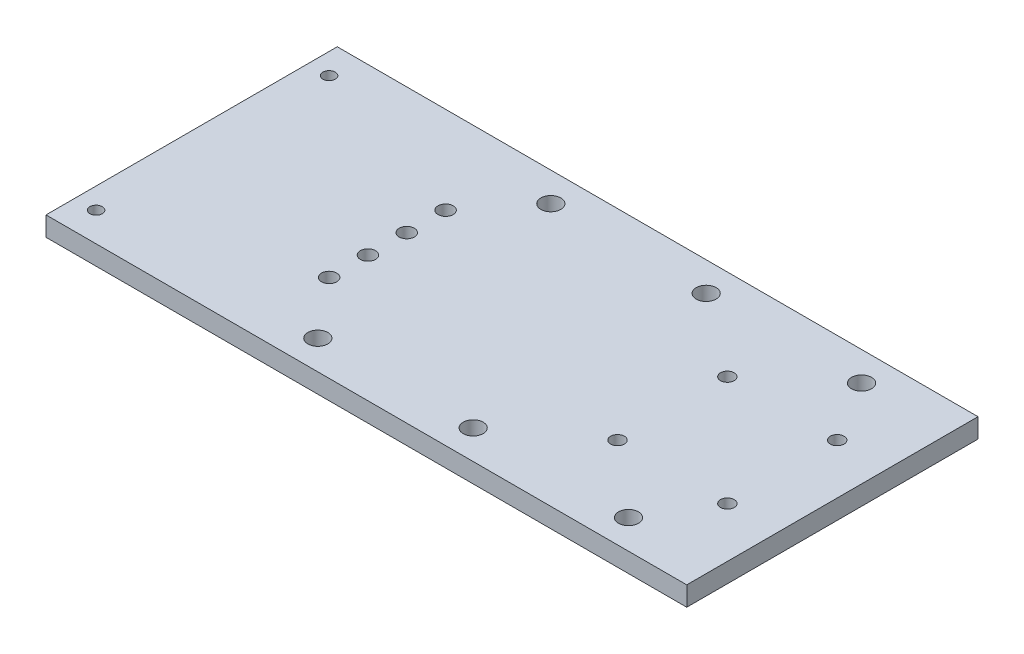
ISO-10303-21;
HEADER;
FILE_DESCRIPTION(('STEP AP214'),'2;1');
FILE_NAME('part.step','',(''),(''),'','','');
FILE_SCHEMA(('AUTOMOTIVE_DESIGN { 1 0 10303 214 1 1 1 1 }'));
ENDSEC;
DATA;
#1=APPLICATION_CONTEXT('core data for automotive mechanical design processes');
#2=APPLICATION_PROTOCOL_DEFINITION('international standard','automotive_design',2000,#1);
#3=PRODUCT_CONTEXT('',#1,'mechanical');
#4=PRODUCT('Part','Part','',(#3));
#5=PRODUCT_RELATED_PRODUCT_CATEGORY('part','',(#4));
#6=PRODUCT_DEFINITION_FORMATION('','',#4);
#7=PRODUCT_DEFINITION_CONTEXT('part definition',#1,'design');
#8=PRODUCT_DEFINITION('design','',#6,#7);
#9=PRODUCT_DEFINITION_SHAPE('','',#8);
#10=(LENGTH_UNIT() NAMED_UNIT(*) SI_UNIT(.MILLI.,.METRE.));
#11=(NAMED_UNIT(*) PLANE_ANGLE_UNIT() SI_UNIT($,.RADIAN.));
#12=(NAMED_UNIT(*) SI_UNIT($,.STERADIAN.) SOLID_ANGLE_UNIT());
#13=UNCERTAINTY_MEASURE_WITH_UNIT(LENGTH_MEASURE(1.E-05),#10,'distance_accuracy_value','');
#14=(GEOMETRIC_REPRESENTATION_CONTEXT(3) GLOBAL_UNCERTAINTY_ASSIGNED_CONTEXT((#13)) GLOBAL_UNIT_ASSIGNED_CONTEXT((#10,
#11,#12)) REPRESENTATION_CONTEXT('',''));
#15=CARTESIAN_POINT('',(0.,0.,0.));
#16=DIRECTION('',(0.,0.,1.));
#17=DIRECTION('',(1.,0.,0.));
#18=AXIS2_PLACEMENT_3D('',#15,#16,#17);
#19=CARTESIAN_POINT('',(104.775,6.35,47.625));
#20=DIRECTION('',(-1.,0.,0.));
#21=DIRECTION('',(0.,0.,1.));
#22=AXIS2_PLACEMENT_3D('',#19,#20,#21);
#23=PLANE('',#22);
#24=DIRECTION('',(0.,0.,-1.));
#25=VECTOR('',#24,1.);
#26=CARTESIAN_POINT('',(104.775,0.,47.625));
#27=LINE('',#26,#25);
#28=CARTESIAN_POINT('',(104.775,0.,47.625));
#29=VERTEX_POINT('',#28);
#30=CARTESIAN_POINT('',(104.775,0.,-47.625));
#31=VERTEX_POINT('',#30);
#32=EDGE_CURVE('E107',#29,#31,#27,.T.);
#33=ORIENTED_EDGE('',*,*,#32,.T.);
#34=DIRECTION('',(0.,-1.,0.));
#35=VECTOR('',#34,1.);
#36=CARTESIAN_POINT('',(104.775,6.35,-47.625));
#37=LINE('',#36,#35);
#38=CARTESIAN_POINT('',(104.775,6.35,-47.625));
#39=VERTEX_POINT('',#38);
#40=EDGE_CURVE('E11',#39,#31,#37,.T.);
#41=ORIENTED_EDGE('',*,*,#40,.F.);
#42=DIRECTION('',(0.,0.,-1.));
#43=VECTOR('',#42,1.);
#44=CARTESIAN_POINT('',(104.775,6.35,47.625));
#45=LINE('',#44,#43);
#46=CARTESIAN_POINT('',(104.775,6.35,47.625));
#47=VERTEX_POINT('',#46);
#48=EDGE_CURVE('E91',#47,#39,#45,.T.);
#49=ORIENTED_EDGE('',*,*,#48,.F.);
#50=DIRECTION('',(0.,-1.,0.));
#51=VECTOR('',#50,1.);
#52=CARTESIAN_POINT('',(104.775,6.35,47.625));
#53=LINE('',#52,#51);
#54=EDGE_CURVE('E103',#47,#29,#53,.T.);
#55=ORIENTED_EDGE('',*,*,#54,.T.);
#56=EDGE_LOOP('',(#33,#41,#49,#55));
#57=FACE_BOUND('',#56,.T.);
#58=ADVANCED_FACE('F39',(#57),#23,.F.);
#59=CARTESIAN_POINT('',(-104.775,6.35,-47.625));
#60=DIRECTION('',(0.,0.,1.));
#61=DIRECTION('',(1.,0.,0.));
#62=AXIS2_PLACEMENT_3D('',#59,#60,#61);
#63=PLANE('',#62);
#64=DIRECTION('',(-1.,0.,0.));
#65=VECTOR('',#64,1.);
#66=CARTESIAN_POINT('',(-104.775,0.,-47.625));
#67=LINE('',#66,#65);
#68=CARTESIAN_POINT('',(-104.775,0.,-47.625));
#69=VERTEX_POINT('',#68);
#70=EDGE_CURVE('E96',#31,#69,#67,.T.);
#71=ORIENTED_EDGE('',*,*,#70,.T.);
#72=DIRECTION('',(0.,-1.,0.));
#73=VECTOR('',#72,1.);
#74=CARTESIAN_POINT('',(-104.775,6.35,-47.625));
#75=LINE('',#74,#73);
#76=CARTESIAN_POINT('',(-104.775,6.35,-47.625));
#77=VERTEX_POINT('',#76);
#78=EDGE_CURVE('E48',#77,#69,#75,.T.);
#79=ORIENTED_EDGE('',*,*,#78,.F.);
#80=DIRECTION('',(-1.,0.,0.));
#81=VECTOR('',#80,1.);
#82=CARTESIAN_POINT('',(-104.775,6.35,-47.625));
#83=LINE('',#82,#81);
#84=EDGE_CURVE('E86',#39,#77,#83,.T.);
#85=ORIENTED_EDGE('',*,*,#84,.F.);
#86=ORIENTED_EDGE('',*,*,#40,.T.);
#87=EDGE_LOOP('',(#71,#79,#85,#86));
#88=FACE_BOUND('',#87,.T.);
#89=ADVANCED_FACE('F95',(#88),#63,.F.);
#90=CARTESIAN_POINT('',(-104.775,6.35,47.625));
#91=DIRECTION('',(1.,0.,0.));
#92=DIRECTION('',(0.,0.,-1.));
#93=AXIS2_PLACEMENT_3D('',#90,#91,#92);
#94=PLANE('',#93);
#95=DIRECTION('',(0.,0.,1.));
#96=VECTOR('',#95,1.);
#97=CARTESIAN_POINT('',(-104.775,0.,47.625));
#98=LINE('',#97,#96);
#99=CARTESIAN_POINT('',(-104.775,0.,47.625));
#100=VERTEX_POINT('',#99);
#101=EDGE_CURVE('E73',#69,#100,#98,.T.);
#102=ORIENTED_EDGE('',*,*,#101,.T.);
#103=DIRECTION('',(0.,-1.,0.));
#104=VECTOR('',#103,1.);
#105=CARTESIAN_POINT('',(-104.775,6.35,47.625));
#106=LINE('',#105,#104);
#107=CARTESIAN_POINT('',(-104.775,6.35,47.625));
#108=VERTEX_POINT('',#107);
#109=EDGE_CURVE('E98',#108,#100,#106,.T.);
#110=ORIENTED_EDGE('',*,*,#109,.F.);
#111=DIRECTION('',(0.,0.,1.));
#112=VECTOR('',#111,1.);
#113=CARTESIAN_POINT('',(-104.775,6.35,47.625));
#114=LINE('',#113,#112);
#115=EDGE_CURVE('E89',#77,#108,#114,.T.);
#116=ORIENTED_EDGE('',*,*,#115,.F.);
#117=ORIENTED_EDGE('',*,*,#78,.T.);
#118=EDGE_LOOP('',(#102,#110,#116,#117));
#119=FACE_BOUND('',#118,.T.);
#120=ADVANCED_FACE('F99',(#119),#94,.F.);
#121=CARTESIAN_POINT('',(-104.775,6.35,47.625));
#122=DIRECTION('',(0.,0.,-1.));
#123=DIRECTION('',(-1.,0.,0.));
#124=AXIS2_PLACEMENT_3D('',#121,#122,#123);
#125=PLANE('',#124);
#126=DIRECTION('',(1.,0.,0.));
#127=VECTOR('',#126,1.);
#128=CARTESIAN_POINT('',(-104.775,0.,47.625));
#129=LINE('',#128,#127);
#130=EDGE_CURVE('E79',#100,#29,#129,.T.);
#131=ORIENTED_EDGE('',*,*,#130,.T.);
#132=ORIENTED_EDGE('',*,*,#54,.F.);
#133=DIRECTION('',(1.,0.,0.));
#134=VECTOR('',#133,1.);
#135=CARTESIAN_POINT('',(-104.775,6.35,47.625));
#136=LINE('',#135,#134);
#137=EDGE_CURVE('E56',#108,#47,#136,.T.);
#138=ORIENTED_EDGE('',*,*,#137,.F.);
#139=ORIENTED_EDGE('',*,*,#109,.T.);
#140=EDGE_LOOP('',(#131,#132,#138,#139));
#141=FACE_BOUND('',#140,.T.);
#142=ADVANCED_FACE('F121',(#141),#125,.F.);
#143=CARTESIAN_POINT('',(0.,6.35,0.));
#144=DIRECTION('',(0.,-1.,0.));
#145=DIRECTION('',(0.,0.,-1.));
#146=AXIS2_PLACEMENT_3D('',#143,#144,#145);
#147=PLANE('',#146);
#148=CARTESIAN_POINT('',(-25.4,6.35,38.1));
#149=DIRECTION('',(0.,-1.,0.));
#150=DIRECTION('',(0.,0.,-1.));
#151=AXIS2_PLACEMENT_3D('',#148,#149,#150);
#152=CIRCLE('',#151,3.2639);
#153=CARTESIAN_POINT('',(-25.4,6.35,34.8361));
#154=VERTEX_POINT('',#153);
#155=EDGE_CURVE('E248',#154,#154,#152,.T.);
#156=ORIENTED_EDGE('',*,*,#155,.T.);
#157=EDGE_LOOP('',(#156));
#158=FACE_BOUND('',#157,.T.);
#159=CARTESIAN_POINT('',(25.4,6.35,38.1));
#160=DIRECTION('',(0.,-1.,0.));
#161=DIRECTION('',(0.,0.,-1.));
#162=AXIS2_PLACEMENT_3D('',#159,#160,#161);
#163=CIRCLE('',#162,3.2639);
#164=CARTESIAN_POINT('',(25.4,6.35,34.8361));
#165=VERTEX_POINT('',#164);
#166=EDGE_CURVE('E240',#165,#165,#163,.T.);
#167=ORIENTED_EDGE('',*,*,#166,.T.);
#168=EDGE_LOOP('',(#167));
#169=FACE_BOUND('',#168,.T.);
#170=CARTESIAN_POINT('',(76.2,6.35,38.1));
#171=DIRECTION('',(0.,-1.,0.));
#172=DIRECTION('',(0.,0.,-1.));
#173=AXIS2_PLACEMENT_3D('',#170,#171,#172);
#174=CIRCLE('',#173,3.2639);
#175=CARTESIAN_POINT('',(76.2,6.35,34.8361));
#176=VERTEX_POINT('',#175);
#177=EDGE_CURVE('E232',#176,#176,#174,.T.);
#178=ORIENTED_EDGE('',*,*,#177,.T.);
#179=EDGE_LOOP('',(#178));
#180=FACE_BOUND('',#179,.T.);
#181=CARTESIAN_POINT('',(-25.4,6.35,-38.1));
#182=DIRECTION('',(0.,1.,0.));
#183=DIRECTION('',(0.,0.,1.));
#184=AXIS2_PLACEMENT_3D('',#181,#182,#183);
#185=CIRCLE('',#184,3.2639);
#186=CARTESIAN_POINT('',(-25.4,6.35,-34.8361));
#187=VERTEX_POINT('',#186);
#188=EDGE_CURVE('E225',#187,#187,#185,.T.);
#189=ORIENTED_EDGE('',*,*,#188,.F.);
#190=EDGE_LOOP('',(#189));
#191=FACE_BOUND('',#190,.T.);
#192=CARTESIAN_POINT('',(25.4,6.35,-38.1));
#193=DIRECTION('',(0.,1.,0.));
#194=DIRECTION('',(0.,0.,1.));
#195=AXIS2_PLACEMENT_3D('',#192,#193,#194);
#196=CIRCLE('',#195,3.2639);
#197=CARTESIAN_POINT('',(25.4,6.35,-34.8361));
#198=VERTEX_POINT('',#197);
#199=EDGE_CURVE('E217',#198,#198,#196,.T.);
#200=ORIENTED_EDGE('',*,*,#199,.F.);
#201=EDGE_LOOP('',(#200));
#202=FACE_BOUND('',#201,.T.);
#203=CARTESIAN_POINT('',(76.2,6.35,-38.1));
#204=DIRECTION('',(0.,1.,0.));
#205=DIRECTION('',(0.,0.,1.));
#206=AXIS2_PLACEMENT_3D('',#203,#204,#205);
#207=CIRCLE('',#206,3.2639);
#208=CARTESIAN_POINT('',(76.2,6.35,-34.8361));
#209=VERTEX_POINT('',#208);
#210=EDGE_CURVE('E208',#209,#209,#207,.T.);
#211=ORIENTED_EDGE('',*,*,#210,.F.);
#212=EDGE_LOOP('',(#211));
#213=FACE_BOUND('',#212,.T.);
#214=CARTESIAN_POINT('',(52.47132,6.35,17.96034));
#215=DIRECTION('',(0.,1.,0.));
#216=DIRECTION('',(0.,0.,1.));
#217=AXIS2_PLACEMENT_3D('',#214,#215,#216);
#218=CIRCLE('',#217,2.2479);
#219=CARTESIAN_POINT('',(52.47132,6.35,20.20824));
#220=VERTEX_POINT('',#219);
#221=EDGE_CURVE('E184',#220,#220,#218,.T.);
#222=ORIENTED_EDGE('',*,*,#221,.F.);
#223=EDGE_LOOP('',(#222));
#224=FACE_BOUND('',#223,.T.);
#225=CARTESIAN_POINT('',(88.392,6.35,17.96034));
#226=DIRECTION('',(0.,1.,0.));
#227=DIRECTION('',(0.,0.,1.));
#228=AXIS2_PLACEMENT_3D('',#225,#226,#227);
#229=CIRCLE('',#228,2.2479);
#230=CARTESIAN_POINT('',(88.392,6.35,20.20824));
#231=VERTEX_POINT('',#230);
#232=EDGE_CURVE('E193',#231,#231,#229,.T.);
#233=ORIENTED_EDGE('',*,*,#232,.F.);
#234=EDGE_LOOP('',(#233));
#235=FACE_BOUND('',#234,.T.);
#236=CARTESIAN_POINT('',(88.392,6.35,-17.96034));
#237=DIRECTION('',(0.,1.,0.));
#238=DIRECTION('',(0.,0.,1.));
#239=AXIS2_PLACEMENT_3D('',#236,#237,#238);
#240=CIRCLE('',#239,2.2479);
#241=CARTESIAN_POINT('',(88.392,6.35,-15.71244));
#242=VERTEX_POINT('',#241);
#243=EDGE_CURVE('E201',#242,#242,#240,.T.);
#244=ORIENTED_EDGE('',*,*,#243,.F.);
#245=EDGE_LOOP('',(#244));
#246=FACE_BOUND('',#245,.T.);
#247=CARTESIAN_POINT('',(52.47132,6.35,-17.96034));
#248=DIRECTION('',(0.,1.,0.));
#249=DIRECTION('',(0.,0.,1.));
#250=AXIS2_PLACEMENT_3D('',#247,#248,#249);
#251=CIRCLE('',#250,2.2479);
#252=CARTESIAN_POINT('',(52.47132,6.35,-15.71244));
#253=VERTEX_POINT('',#252);
#254=EDGE_CURVE('E176',#253,#253,#251,.T.);
#255=ORIENTED_EDGE('',*,*,#254,.F.);
#256=EDGE_LOOP('',(#255));
#257=FACE_BOUND('',#256,.T.);
#258=CARTESIAN_POINT('',(-40.767,6.35,-6.35));
#259=DIRECTION('',(0.,-1.,0.));
#260=DIRECTION('',(0.,0.,-1.));
#261=AXIS2_PLACEMENT_3D('',#258,#259,#260);
#262=CIRCLE('',#261,2.4892);
#263=CARTESIAN_POINT('',(-40.767,6.35,-8.83920000000001));
#264=VERTEX_POINT('',#263);
#265=EDGE_CURVE('E169',#264,#264,#262,.T.);
#266=ORIENTED_EDGE('',*,*,#265,.T.);
#267=EDGE_LOOP('',(#266));
#268=FACE_BOUND('',#267,.T.);
#269=CARTESIAN_POINT('',(-40.767,6.35,-19.05));
#270=DIRECTION('',(0.,-1.,0.));
#271=DIRECTION('',(0.,0.,-1.));
#272=AXIS2_PLACEMENT_3D('',#269,#270,#271);
#273=CIRCLE('',#272,2.4892);
#274=CARTESIAN_POINT('',(-40.767,6.35,-21.5392));
#275=VERTEX_POINT('',#274);
#276=EDGE_CURVE('E160',#275,#275,#273,.T.);
#277=ORIENTED_EDGE('',*,*,#276,.T.);
#278=EDGE_LOOP('',(#277));
#279=FACE_BOUND('',#278,.T.);
#280=CARTESIAN_POINT('',(-40.767,6.35,6.35));
#281=DIRECTION('',(0.,1.,0.));
#282=DIRECTION('',(0.,0.,1.));
#283=AXIS2_PLACEMENT_3D('',#280,#281,#282);
#284=CIRCLE('',#283,2.4892);
#285=CARTESIAN_POINT('',(-40.767,6.35,8.83920000000001));
#286=VERTEX_POINT('',#285);
#287=EDGE_CURVE('E153',#286,#286,#284,.T.);
#288=ORIENTED_EDGE('',*,*,#287,.F.);
#289=EDGE_LOOP('',(#288));
#290=FACE_BOUND('',#289,.T.);
#291=CARTESIAN_POINT('',(-40.767,6.35,19.05));
#292=DIRECTION('',(0.,1.,0.));
#293=DIRECTION('',(0.,0.,1.));
#294=AXIS2_PLACEMENT_3D('',#291,#292,#293);
#295=CIRCLE('',#294,2.4892);
#296=CARTESIAN_POINT('',(-40.767,6.35,21.5392));
#297=VERTEX_POINT('',#296);
#298=EDGE_CURVE('E144',#297,#297,#295,.T.);
#299=ORIENTED_EDGE('',*,*,#298,.F.);
#300=EDGE_LOOP('',(#299));
#301=FACE_BOUND('',#300,.T.);
#302=CARTESIAN_POINT('',(-97.917,6.35,-38.1));
#303=DIRECTION('',(0.,-1.,0.));
#304=DIRECTION('',(0.,0.,-1.));
#305=AXIS2_PLACEMENT_3D('',#302,#303,#304);
#306=CIRCLE('',#305,2.01930000000001);
#307=CARTESIAN_POINT('',(-97.917,6.35,-40.1193));
#308=VERTEX_POINT('',#307);
#309=EDGE_CURVE('E136',#308,#308,#306,.T.);
#310=ORIENTED_EDGE('',*,*,#309,.T.);
#311=EDGE_LOOP('',(#310));
#312=FACE_BOUND('',#311,.T.);
#313=CARTESIAN_POINT('',(-97.917,6.35,38.1));
#314=DIRECTION('',(0.,1.,0.));
#315=DIRECTION('',(0.,0.,1.));
#316=AXIS2_PLACEMENT_3D('',#313,#314,#315);
#317=CIRCLE('',#316,2.01930000000001);
#318=CARTESIAN_POINT('',(-97.917,6.35,40.1193));
#319=VERTEX_POINT('',#318);
#320=EDGE_CURVE('E128',#319,#319,#317,.T.);
#321=ORIENTED_EDGE('',*,*,#320,.F.);
#322=EDGE_LOOP('',(#321));
#323=FACE_BOUND('',#322,.T.);
#324=ORIENTED_EDGE('',*,*,#48,.T.);
#325=ORIENTED_EDGE('',*,*,#84,.T.);
#326=ORIENTED_EDGE('',*,*,#115,.T.);
#327=ORIENTED_EDGE('',*,*,#137,.T.);
#328=EDGE_LOOP('',(#324,#325,#326,#327));
#329=FACE_BOUND('',#328,.T.);
#330=ADVANCED_FACE('F87',(#158,#169,#180,#191,#202,#213,#224,#235,#246,#257,#268,#279,#290,#301,
#312,#323,#329),#147,.F.);
#331=CARTESIAN_POINT('',(0.,0.,0.));
#332=DIRECTION('',(0.,-1.,0.));
#333=DIRECTION('',(0.,0.,-1.));
#334=AXIS2_PLACEMENT_3D('',#331,#332,#333);
#335=PLANE('',#334);
#336=CARTESIAN_POINT('',(-25.4,0.,38.1));
#337=DIRECTION('',(0.,-1.,0.));
#338=DIRECTION('',(0.,0.,-1.));
#339=AXIS2_PLACEMENT_3D('',#336,#337,#338);
#340=CIRCLE('',#339,3.2639);
#341=CARTESIAN_POINT('',(-25.4,0.,34.8361));
#342=VERTEX_POINT('',#341);
#343=EDGE_CURVE('E213',#342,#342,#340,.T.);
#344=ORIENTED_EDGE('',*,*,#343,.F.);
#345=EDGE_LOOP('',(#344));
#346=FACE_BOUND('',#345,.T.);
#347=CARTESIAN_POINT('',(25.4,0.,38.1));
#348=DIRECTION('',(0.,-1.,0.));
#349=DIRECTION('',(0.,0.,-1.));
#350=AXIS2_PLACEMENT_3D('',#347,#348,#349);
#351=CIRCLE('',#350,3.2639);
#352=CARTESIAN_POINT('',(25.4,0.,34.8361));
#353=VERTEX_POINT('',#352);
#354=EDGE_CURVE('E244',#353,#353,#351,.T.);
#355=ORIENTED_EDGE('',*,*,#354,.F.);
#356=EDGE_LOOP('',(#355));
#357=FACE_BOUND('',#356,.T.);
#358=CARTESIAN_POINT('',(76.2,0.,38.1));
#359=DIRECTION('',(0.,-1.,0.));
#360=DIRECTION('',(0.,0.,-1.));
#361=AXIS2_PLACEMENT_3D('',#358,#359,#360);
#362=CIRCLE('',#361,3.2639);
#363=CARTESIAN_POINT('',(76.2,0.,34.8361));
#364=VERTEX_POINT('',#363);
#365=EDGE_CURVE('E236',#364,#364,#362,.T.);
#366=ORIENTED_EDGE('',*,*,#365,.F.);
#367=EDGE_LOOP('',(#366));
#368=FACE_BOUND('',#367,.T.);
#369=CARTESIAN_POINT('',(-25.4,0.,-38.1));
#370=DIRECTION('',(0.,1.,0.));
#371=DIRECTION('',(0.,0.,1.));
#372=AXIS2_PLACEMENT_3D('',#369,#370,#371);
#373=CIRCLE('',#372,3.2639);
#374=CARTESIAN_POINT('',(-25.4,0.,-34.8361));
#375=VERTEX_POINT('',#374);
#376=EDGE_CURVE('E189',#375,#375,#373,.T.);
#377=ORIENTED_EDGE('',*,*,#376,.T.);
#378=EDGE_LOOP('',(#377));
#379=FACE_BOUND('',#378,.T.);
#380=CARTESIAN_POINT('',(25.4,0.,-38.1));
#381=DIRECTION('',(0.,1.,0.));
#382=DIRECTION('',(0.,0.,1.));
#383=AXIS2_PLACEMENT_3D('',#380,#381,#382);
#384=CIRCLE('',#383,3.2639);
#385=CARTESIAN_POINT('',(25.4,0.,-34.8361));
#386=VERTEX_POINT('',#385);
#387=EDGE_CURVE('E221',#386,#386,#384,.T.);
#388=ORIENTED_EDGE('',*,*,#387,.T.);
#389=EDGE_LOOP('',(#388));
#390=FACE_BOUND('',#389,.T.);
#391=CARTESIAN_POINT('',(76.2,0.,-38.1));
#392=DIRECTION('',(0.,1.,0.));
#393=DIRECTION('',(0.,0.,1.));
#394=AXIS2_PLACEMENT_3D('',#391,#392,#393);
#395=CIRCLE('',#394,3.2639);
#396=CARTESIAN_POINT('',(76.2,0.,-34.8361));
#397=VERTEX_POINT('',#396);
#398=EDGE_CURVE('E212',#397,#397,#395,.T.);
#399=ORIENTED_EDGE('',*,*,#398,.T.);
#400=EDGE_LOOP('',(#399));
#401=FACE_BOUND('',#400,.T.);
#402=CARTESIAN_POINT('',(52.47132,0.,17.96034));
#403=DIRECTION('',(0.,1.,0.));
#404=DIRECTION('',(0.,0.,1.));
#405=AXIS2_PLACEMENT_3D('',#402,#403,#404);
#406=CIRCLE('',#405,2.2479);
#407=CARTESIAN_POINT('',(52.47132,0.,20.20824));
#408=VERTEX_POINT('',#407);
#409=EDGE_CURVE('E188',#408,#408,#406,.T.);
#410=ORIENTED_EDGE('',*,*,#409,.T.);
#411=EDGE_LOOP('',(#410));
#412=FACE_BOUND('',#411,.T.);
#413=CARTESIAN_POINT('',(88.392,0.,17.96034));
#414=DIRECTION('',(0.,1.,0.));
#415=DIRECTION('',(0.,0.,1.));
#416=AXIS2_PLACEMENT_3D('',#413,#414,#415);
#417=CIRCLE('',#416,2.2479);
#418=CARTESIAN_POINT('',(88.392,0.,20.20824));
#419=VERTEX_POINT('',#418);
#420=EDGE_CURVE('E197',#419,#419,#417,.T.);
#421=ORIENTED_EDGE('',*,*,#420,.T.);
#422=EDGE_LOOP('',(#421));
#423=FACE_BOUND('',#422,.T.);
#424=CARTESIAN_POINT('',(88.392,0.,-17.96034));
#425=DIRECTION('',(0.,1.,0.));
#426=DIRECTION('',(0.,0.,1.));
#427=AXIS2_PLACEMENT_3D('',#424,#425,#426);
#428=CIRCLE('',#427,2.2479);
#429=CARTESIAN_POINT('',(88.392,0.,-15.71244));
#430=VERTEX_POINT('',#429);
#431=EDGE_CURVE('E180',#430,#430,#428,.T.);
#432=ORIENTED_EDGE('',*,*,#431,.T.);
#433=EDGE_LOOP('',(#432));
#434=FACE_BOUND('',#433,.T.);
#435=CARTESIAN_POINT('',(52.47132,0.,-17.96034));
#436=DIRECTION('',(0.,1.,0.));
#437=DIRECTION('',(0.,0.,1.));
#438=AXIS2_PLACEMENT_3D('',#435,#436,#437);
#439=CIRCLE('',#438,2.2479);
#440=CARTESIAN_POINT('',(52.47132,0.,-15.71244));
#441=VERTEX_POINT('',#440);
#442=EDGE_CURVE('E165',#441,#441,#439,.T.);
#443=ORIENTED_EDGE('',*,*,#442,.T.);
#444=EDGE_LOOP('',(#443));
#445=FACE_BOUND('',#444,.T.);
#446=CARTESIAN_POINT('',(-40.767,0.,-6.35));
#447=DIRECTION('',(0.,-1.,0.));
#448=DIRECTION('',(0.,0.,-1.));
#449=AXIS2_PLACEMENT_3D('',#446,#447,#448);
#450=CIRCLE('',#449,2.4892);
#451=CARTESIAN_POINT('',(-40.767,0.,-8.83920000000001));
#452=VERTEX_POINT('',#451);
#453=EDGE_CURVE('E149',#452,#452,#450,.T.);
#454=ORIENTED_EDGE('',*,*,#453,.F.);
#455=EDGE_LOOP('',(#454));
#456=FACE_BOUND('',#455,.T.);
#457=CARTESIAN_POINT('',(-40.767,0.,-19.05));
#458=DIRECTION('',(0.,-1.,0.));
#459=DIRECTION('',(0.,0.,-1.));
#460=AXIS2_PLACEMENT_3D('',#457,#458,#459);
#461=CIRCLE('',#460,2.4892);
#462=CARTESIAN_POINT('',(-40.767,0.,-21.5392));
#463=VERTEX_POINT('',#462);
#464=EDGE_CURVE('E164',#463,#463,#461,.T.);
#465=ORIENTED_EDGE('',*,*,#464,.F.);
#466=EDGE_LOOP('',(#465));
#467=FACE_BOUND('',#466,.T.);
#468=CARTESIAN_POINT('',(-40.767,0.,6.35));
#469=DIRECTION('',(0.,1.,0.));
#470=DIRECTION('',(0.,0.,1.));
#471=AXIS2_PLACEMENT_3D('',#468,#469,#470);
#472=CIRCLE('',#471,2.4892);
#473=CARTESIAN_POINT('',(-40.767,0.,8.83920000000001));
#474=VERTEX_POINT('',#473);
#475=EDGE_CURVE('E140',#474,#474,#472,.T.);
#476=ORIENTED_EDGE('',*,*,#475,.T.);
#477=EDGE_LOOP('',(#476));
#478=FACE_BOUND('',#477,.T.);
#479=CARTESIAN_POINT('',(-40.767,0.,19.05));
#480=DIRECTION('',(0.,1.,0.));
#481=DIRECTION('',(0.,0.,1.));
#482=AXIS2_PLACEMENT_3D('',#479,#480,#481);
#483=CIRCLE('',#482,2.4892);
#484=CARTESIAN_POINT('',(-40.767,0.,21.5392));
#485=VERTEX_POINT('',#484);
#486=EDGE_CURVE('E148',#485,#485,#483,.T.);
#487=ORIENTED_EDGE('',*,*,#486,.T.);
#488=EDGE_LOOP('',(#487));
#489=FACE_BOUND('',#488,.T.);
#490=CARTESIAN_POINT('',(-97.917,0.,-38.1));
#491=DIRECTION('',(0.,-1.,0.));
#492=DIRECTION('',(0.,0.,-1.));
#493=AXIS2_PLACEMENT_3D('',#490,#491,#492);
#494=CIRCLE('',#493,2.01930000000001);
#495=CARTESIAN_POINT('',(-97.917,0.,-40.1193));
#496=VERTEX_POINT('',#495);
#497=EDGE_CURVE('E132',#496,#496,#494,.T.);
#498=ORIENTED_EDGE('',*,*,#497,.F.);
#499=EDGE_LOOP('',(#498));
#500=FACE_BOUND('',#499,.T.);
#501=CARTESIAN_POINT('',(-97.917,0.,38.1));
#502=DIRECTION('',(0.,1.,0.));
#503=DIRECTION('',(0.,0.,1.));
#504=AXIS2_PLACEMENT_3D('',#501,#502,#503);
#505=CIRCLE('',#504,2.01930000000001);
#506=CARTESIAN_POINT('',(-97.917,0.,40.1193));
#507=VERTEX_POINT('',#506);
#508=EDGE_CURVE('E111',#507,#507,#505,.T.);
#509=ORIENTED_EDGE('',*,*,#508,.T.);
#510=EDGE_LOOP('',(#509));
#511=FACE_BOUND('',#510,.T.);
#512=ORIENTED_EDGE('',*,*,#32,.F.);
#513=ORIENTED_EDGE('',*,*,#130,.F.);
#514=ORIENTED_EDGE('',*,*,#101,.F.);
#515=ORIENTED_EDGE('',*,*,#70,.F.);
#516=EDGE_LOOP('',(#512,#513,#514,#515));
#517=FACE_BOUND('',#516,.T.);
#518=ADVANCED_FACE('F124',(#346,#357,#368,#379,#390,#401,#412,#423,#434,#445,#456,#467,#478,
#489,#500,#511,#517),#335,.T.);
#519=CARTESIAN_POINT('',(-97.917,0.,38.1));
#520=DIRECTION('',(0.,1.,0.));
#521=DIRECTION('',(0.,0.,1.));
#522=AXIS2_PLACEMENT_3D('',#519,#520,#521);
#523=CYLINDRICAL_SURFACE('',#522,2.01930000000001);
#524=ORIENTED_EDGE('',*,*,#508,.F.);
#525=EDGE_LOOP('',(#524));
#526=FACE_BOUND('',#525,.T.);
#527=ORIENTED_EDGE('',*,*,#320,.T.);
#528=EDGE_LOOP('',(#527));
#529=FACE_BOUND('',#528,.T.);
#530=ADVANCED_FACE('F261',(#526,#529),#523,.F.);
#531=CARTESIAN_POINT('',(-97.917,0.,-38.1));
#532=DIRECTION('',(0.,1.,0.));
#533=DIRECTION('',(0.,0.,1.));
#534=AXIS2_PLACEMENT_3D('',#531,#532,#533);
#535=CYLINDRICAL_SURFACE('',#534,2.01930000000001);
#536=ORIENTED_EDGE('',*,*,#497,.T.);
#537=EDGE_LOOP('',(#536));
#538=FACE_BOUND('',#537,.T.);
#539=ORIENTED_EDGE('',*,*,#309,.F.);
#540=EDGE_LOOP('',(#539));
#541=FACE_BOUND('',#540,.T.);
#542=ADVANCED_FACE('F295',(#538,#541),#535,.F.);
#543=CARTESIAN_POINT('',(-40.767,0.,19.05));
#544=DIRECTION('',(0.,1.,0.));
#545=DIRECTION('',(0.,0.,1.));
#546=AXIS2_PLACEMENT_3D('',#543,#544,#545);
#547=CYLINDRICAL_SURFACE('',#546,2.4892);
#548=ORIENTED_EDGE('',*,*,#486,.F.);
#549=EDGE_LOOP('',(#548));
#550=FACE_BOUND('',#549,.T.);
#551=ORIENTED_EDGE('',*,*,#298,.T.);
#552=EDGE_LOOP('',(#551));
#553=FACE_BOUND('',#552,.T.);
#554=ADVANCED_FACE('F338',(#550,#553),#547,.F.);
#555=CARTESIAN_POINT('',(-40.767,0.,6.35));
#556=DIRECTION('',(0.,1.,0.));
#557=DIRECTION('',(0.,0.,1.));
#558=AXIS2_PLACEMENT_3D('',#555,#556,#557);
#559=CYLINDRICAL_SURFACE('',#558,2.4892);
#560=ORIENTED_EDGE('',*,*,#475,.F.);
#561=EDGE_LOOP('',(#560));
#562=FACE_BOUND('',#561,.T.);
#563=ORIENTED_EDGE('',*,*,#287,.T.);
#564=EDGE_LOOP('',(#563));
#565=FACE_BOUND('',#564,.T.);
#566=ADVANCED_FACE('F348',(#562,#565),#559,.F.);
#567=CARTESIAN_POINT('',(-40.767,0.,-19.05));
#568=DIRECTION('',(0.,1.,0.));
#569=DIRECTION('',(0.,0.,1.));
#570=AXIS2_PLACEMENT_3D('',#567,#568,#569);
#571=CYLINDRICAL_SURFACE('',#570,2.4892);
#572=ORIENTED_EDGE('',*,*,#464,.T.);
#573=EDGE_LOOP('',(#572));
#574=FACE_BOUND('',#573,.T.);
#575=ORIENTED_EDGE('',*,*,#276,.F.);
#576=EDGE_LOOP('',(#575));
#577=FACE_BOUND('',#576,.T.);
#578=ADVANCED_FACE('F358',(#574,#577),#571,.F.);
#579=CARTESIAN_POINT('',(-40.767,0.,-6.35));
#580=DIRECTION('',(0.,1.,0.));
#581=DIRECTION('',(0.,0.,1.));
#582=AXIS2_PLACEMENT_3D('',#579,#580,#581);
#583=CYLINDRICAL_SURFACE('',#582,2.4892);
#584=ORIENTED_EDGE('',*,*,#453,.T.);
#585=EDGE_LOOP('',(#584));
#586=FACE_BOUND('',#585,.T.);
#587=ORIENTED_EDGE('',*,*,#265,.F.);
#588=EDGE_LOOP('',(#587));
#589=FACE_BOUND('',#588,.T.);
#590=ADVANCED_FACE('F368',(#586,#589),#583,.F.);
#591=CARTESIAN_POINT('',(52.47132,0.,-17.96034));
#592=DIRECTION('',(0.,1.,0.));
#593=DIRECTION('',(0.,0.,1.));
#594=AXIS2_PLACEMENT_3D('',#591,#592,#593);
#595=CYLINDRICAL_SURFACE('',#594,2.2479);
#596=ORIENTED_EDGE('',*,*,#442,.F.);
#597=EDGE_LOOP('',(#596));
#598=FACE_BOUND('',#597,.T.);
#599=ORIENTED_EDGE('',*,*,#254,.T.);
#600=EDGE_LOOP('',(#599));
#601=FACE_BOUND('',#600,.T.);
#602=ADVANCED_FACE('F378',(#598,#601),#595,.F.);
#603=CARTESIAN_POINT('',(88.392,0.,-17.96034));
#604=DIRECTION('',(0.,1.,0.));
#605=DIRECTION('',(0.,0.,1.));
#606=AXIS2_PLACEMENT_3D('',#603,#604,#605);
#607=CYLINDRICAL_SURFACE('',#606,2.2479);
#608=ORIENTED_EDGE('',*,*,#431,.F.);
#609=EDGE_LOOP('',(#608));
#610=FACE_BOUND('',#609,.T.);
#611=ORIENTED_EDGE('',*,*,#243,.T.);
#612=EDGE_LOOP('',(#611));
#613=FACE_BOUND('',#612,.T.);
#614=ADVANCED_FACE('F388',(#610,#613),#607,.F.);
#615=CARTESIAN_POINT('',(88.392,0.,17.96034));
#616=DIRECTION('',(0.,1.,0.));
#617=DIRECTION('',(0.,0.,1.));
#618=AXIS2_PLACEMENT_3D('',#615,#616,#617);
#619=CYLINDRICAL_SURFACE('',#618,2.2479);
#620=ORIENTED_EDGE('',*,*,#420,.F.);
#621=EDGE_LOOP('',(#620));
#622=FACE_BOUND('',#621,.T.);
#623=ORIENTED_EDGE('',*,*,#232,.T.);
#624=EDGE_LOOP('',(#623));
#625=FACE_BOUND('',#624,.T.);
#626=ADVANCED_FACE('F398',(#622,#625),#619,.F.);
#627=CARTESIAN_POINT('',(52.47132,0.,17.96034));
#628=DIRECTION('',(0.,1.,0.));
#629=DIRECTION('',(0.,0.,1.));
#630=AXIS2_PLACEMENT_3D('',#627,#628,#629);
#631=CYLINDRICAL_SURFACE('',#630,2.2479);
#632=ORIENTED_EDGE('',*,*,#409,.F.);
#633=EDGE_LOOP('',(#632));
#634=FACE_BOUND('',#633,.T.);
#635=ORIENTED_EDGE('',*,*,#221,.T.);
#636=EDGE_LOOP('',(#635));
#637=FACE_BOUND('',#636,.T.);
#638=ADVANCED_FACE('F408',(#634,#637),#631,.F.);
#639=CARTESIAN_POINT('',(76.2,0.,-38.1));
#640=DIRECTION('',(0.,1.,0.));
#641=DIRECTION('',(0.,0.,1.));
#642=AXIS2_PLACEMENT_3D('',#639,#640,#641);
#643=CYLINDRICAL_SURFACE('',#642,3.2639);
#644=ORIENTED_EDGE('',*,*,#398,.F.);
#645=EDGE_LOOP('',(#644));
#646=FACE_BOUND('',#645,.T.);
#647=ORIENTED_EDGE('',*,*,#210,.T.);
#648=EDGE_LOOP('',(#647));
#649=FACE_BOUND('',#648,.T.);
#650=ADVANCED_FACE('F418',(#646,#649),#643,.F.);
#651=CARTESIAN_POINT('',(25.4,0.,-38.1));
#652=DIRECTION('',(0.,1.,0.));
#653=DIRECTION('',(0.,0.,1.));
#654=AXIS2_PLACEMENT_3D('',#651,#652,#653);
#655=CYLINDRICAL_SURFACE('',#654,3.2639);
#656=ORIENTED_EDGE('',*,*,#387,.F.);
#657=EDGE_LOOP('',(#656));
#658=FACE_BOUND('',#657,.T.);
#659=ORIENTED_EDGE('',*,*,#199,.T.);
#660=EDGE_LOOP('',(#659));
#661=FACE_BOUND('',#660,.T.);
#662=ADVANCED_FACE('F428',(#658,#661),#655,.F.);
#663=CARTESIAN_POINT('',(-25.4,0.,-38.1));
#664=DIRECTION('',(0.,1.,0.));
#665=DIRECTION('',(0.,0.,1.));
#666=AXIS2_PLACEMENT_3D('',#663,#664,#665);
#667=CYLINDRICAL_SURFACE('',#666,3.2639);
#668=ORIENTED_EDGE('',*,*,#376,.F.);
#669=EDGE_LOOP('',(#668));
#670=FACE_BOUND('',#669,.T.);
#671=ORIENTED_EDGE('',*,*,#188,.T.);
#672=EDGE_LOOP('',(#671));
#673=FACE_BOUND('',#672,.T.);
#674=ADVANCED_FACE('F438',(#670,#673),#667,.F.);
#675=CARTESIAN_POINT('',(76.2,0.,38.1));
#676=DIRECTION('',(0.,1.,0.));
#677=DIRECTION('',(0.,0.,1.));
#678=AXIS2_PLACEMENT_3D('',#675,#676,#677);
#679=CYLINDRICAL_SURFACE('',#678,3.2639);
#680=ORIENTED_EDGE('',*,*,#365,.T.);
#681=EDGE_LOOP('',(#680));
#682=FACE_BOUND('',#681,.T.);
#683=ORIENTED_EDGE('',*,*,#177,.F.);
#684=EDGE_LOOP('',(#683));
#685=FACE_BOUND('',#684,.T.);
#686=ADVANCED_FACE('F447',(#682,#685),#679,.F.);
#687=CARTESIAN_POINT('',(25.4,0.,38.1));
#688=DIRECTION('',(0.,1.,0.));
#689=DIRECTION('',(0.,0.,1.));
#690=AXIS2_PLACEMENT_3D('',#687,#688,#689);
#691=CYLINDRICAL_SURFACE('',#690,3.2639);
#692=ORIENTED_EDGE('',*,*,#354,.T.);
#693=EDGE_LOOP('',(#692));
#694=FACE_BOUND('',#693,.T.);
#695=ORIENTED_EDGE('',*,*,#166,.F.);
#696=EDGE_LOOP('',(#695));
#697=FACE_BOUND('',#696,.T.);
#698=ADVANCED_FACE('F466',(#694,#697),#691,.F.);
#699=CARTESIAN_POINT('',(-25.4,0.,38.1));
#700=DIRECTION('',(0.,1.,0.));
#701=DIRECTION('',(0.,0.,1.));
#702=AXIS2_PLACEMENT_3D('',#699,#700,#701);
#703=CYLINDRICAL_SURFACE('',#702,3.2639);
#704=ORIENTED_EDGE('',*,*,#343,.T.);
#705=EDGE_LOOP('',(#704));
#706=FACE_BOUND('',#705,.T.);
#707=ORIENTED_EDGE('',*,*,#155,.F.);
#708=EDGE_LOOP('',(#707));
#709=FACE_BOUND('',#708,.T.);
#710=ADVANCED_FACE('F256',(#706,#709),#703,.F.);
#711=CLOSED_SHELL('',(#58,#89,#120,#142,#330,#518,#530,#542,#554,#566,#578,#590,#602,#614,#626,
#638,#650,#662,#674,#686,#698,#710));
#712=MANIFOLD_SOLID_BREP('B2',#711);
#713=ADVANCED_BREP_SHAPE_REPRESENTATION('',(#18,#712),#14);
#714=SHAPE_DEFINITION_REPRESENTATION(#9,#713);
ENDSEC;
END-ISO-10303-21;
